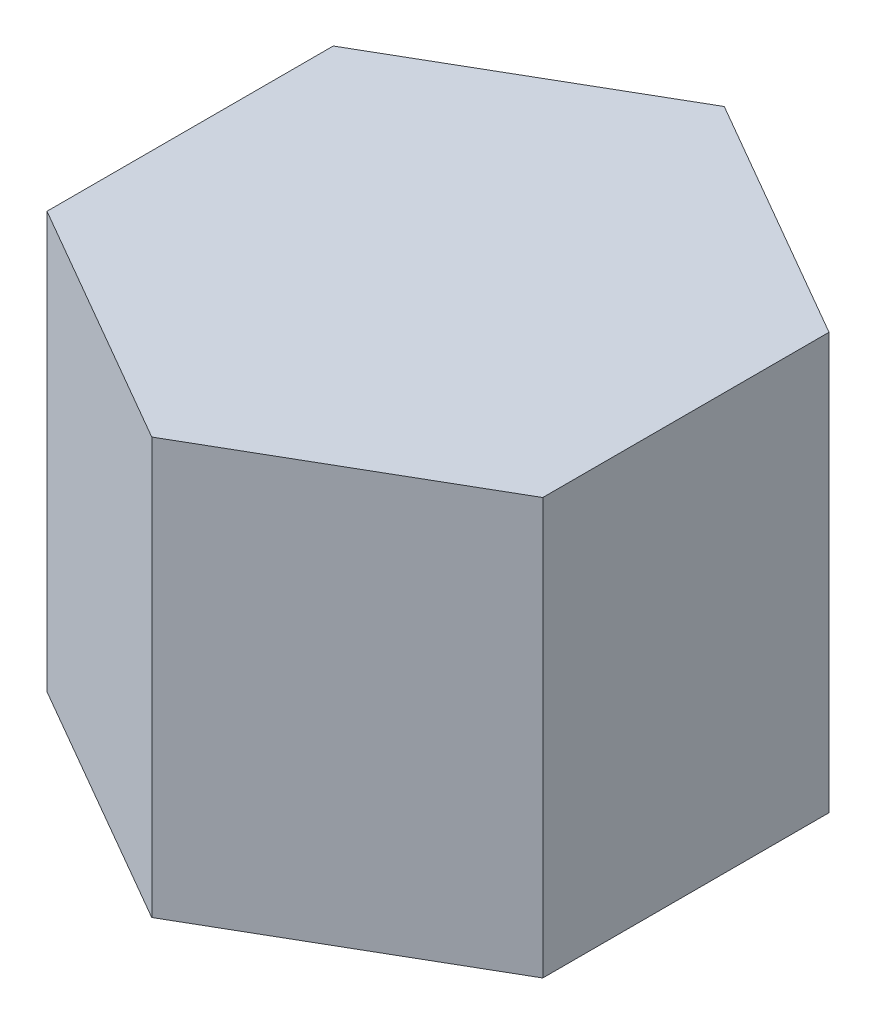
ISO-10303-21;
HEADER;
FILE_DESCRIPTION(('STEP AP214'),'2;1');
FILE_NAME('part.step','',(''),(''),'','','');
FILE_SCHEMA(('AUTOMOTIVE_DESIGN { 1 0 10303 214 1 1 1 1 }'));
ENDSEC;
DATA;
#1=APPLICATION_CONTEXT('core data for automotive mechanical design processes');
#2=APPLICATION_PROTOCOL_DEFINITION('international standard','automotive_design',2000,#1);
#3=PRODUCT_CONTEXT('',#1,'mechanical');
#4=PRODUCT('Part','Part','',(#3));
#5=PRODUCT_RELATED_PRODUCT_CATEGORY('part','',(#4));
#6=PRODUCT_DEFINITION_FORMATION('','',#4);
#7=PRODUCT_DEFINITION_CONTEXT('part definition',#1,'design');
#8=PRODUCT_DEFINITION('design','',#6,#7);
#9=PRODUCT_DEFINITION_SHAPE('','',#8);
#10=(LENGTH_UNIT() NAMED_UNIT(*) SI_UNIT(.MILLI.,.METRE.));
#11=(NAMED_UNIT(*) PLANE_ANGLE_UNIT() SI_UNIT($,.RADIAN.));
#12=(NAMED_UNIT(*) SI_UNIT($,.STERADIAN.) SOLID_ANGLE_UNIT());
#13=UNCERTAINTY_MEASURE_WITH_UNIT(LENGTH_MEASURE(1.E-05),#10,'distance_accuracy_value','');
#14=(GEOMETRIC_REPRESENTATION_CONTEXT(3) GLOBAL_UNCERTAINTY_ASSIGNED_CONTEXT((#13)) GLOBAL_UNIT_ASSIGNED_CONTEXT((#10,
#11,#12)) REPRESENTATION_CONTEXT('',''));
#15=CARTESIAN_POINT('',(0.,0.,0.));
#16=DIRECTION('',(0.,0.,1.));
#17=DIRECTION('',(1.,0.,0.));
#18=AXIS2_PLACEMENT_3D('',#15,#16,#17);
#19=CARTESIAN_POINT('',(207.339551417382,-147.556598747966,291.681971220494));
#20=DIRECTION('',(-0.500000000000028,0.,-0.866025403784422));
#21=DIRECTION('',(-0.866025403784423,0.,0.500000000000028));
#22=AXIS2_PLACEMENT_3D('',#19,#20,#21);
#23=PLANE('',#22);
#24=CARTESIAN_POINT('',(207.642660308706,-147.047793579175,291.506971220494));
#25=DIRECTION('',(-0.866025403784422,0.,0.500000000000028));
#26=VECTOR('',#25,1.);
#27=LINE('',#24,#26);
#28=CARTESIAN_POINT('',(207.642660308706,-147.047793579175,291.506971220494));
#29=VERTEX_POINT('',#28);
#30=CARTESIAN_POINT('',(207.339551417382,-147.047793579175,291.681971220494));
#31=VERTEX_POINT('',#30);
#32=EDGE_CURVE('E170',#29,#31,#27,.T.);
#33=ORIENTED_EDGE('',*,*,#32,.T.);
#34=CARTESIAN_POINT('',(207.339551417382,-147.556598747966,291.681971220494));
#35=DIRECTION('',(0.,1.,0.));
#36=VECTOR('',#35,1.);
#37=LINE('',#34,#36);
#38=CARTESIAN_POINT('',(207.339551417382,-147.556598747966,291.681971220494));
#39=VERTEX_POINT('',#38);
#40=EDGE_CURVE('E35',#39,#31,#37,.T.);
#41=ORIENTED_EDGE('',*,*,#40,.F.);
#42=CARTESIAN_POINT('',(207.642660308706,-147.556598747966,291.506971220494));
#43=DIRECTION('',(-0.866025403784422,0.,0.500000000000028));
#44=VECTOR('',#43,1.);
#45=LINE('',#42,#44);
#46=CARTESIAN_POINT('',(207.642660308706,-147.556598747966,291.506971220494));
#47=VERTEX_POINT('',#46);
#48=EDGE_CURVE('E159',#47,#39,#45,.T.);
#49=ORIENTED_EDGE('',*,*,#48,.F.);
#50=CARTESIAN_POINT('',(207.642660308706,-147.556598747966,291.506971220494));
#51=DIRECTION('',(0.,1.,0.));
#52=VECTOR('',#51,1.);
#53=LINE('',#50,#52);
#54=EDGE_CURVE('E10',#47,#29,#53,.T.);
#55=ORIENTED_EDGE('',*,*,#54,.T.);
#56=EDGE_LOOP('',(#33,#41,#49,#55));
#57=FACE_BOUND('',#56,.T.);
#58=ADVANCED_FACE('F16',(#57),#23,.F.);
#59=CARTESIAN_POINT('',(207.642660308706,-147.556598747966,291.594471220494));
#60=DIRECTION('',(-1.,0.,0.));
#61=DIRECTION('',(0.,-1.,0.));
#62=AXIS2_PLACEMENT_3D('',#59,#60,#61);
#63=PLANE('',#62);
#64=CARTESIAN_POINT('',(207.642660308706,-147.047793579175,291.156971220494));
#65=DIRECTION('',(0.,0.,1.));
#66=VECTOR('',#65,1.);
#67=LINE('',#64,#66);
#68=CARTESIAN_POINT('',(207.642660308706,-147.047793579175,291.156971220494));
#69=VERTEX_POINT('',#68);
#70=EDGE_CURVE('E167',#69,#29,#67,.T.);
#71=ORIENTED_EDGE('',*,*,#70,.T.);
#72=ORIENTED_EDGE('',*,*,#54,.F.);
#73=CARTESIAN_POINT('',(207.642660308706,-147.556598747966,291.156971220494));
#74=DIRECTION('',(0.,0.,1.));
#75=VECTOR('',#74,1.);
#76=LINE('',#73,#75);
#77=CARTESIAN_POINT('',(207.642660308706,-147.556598747966,291.156971220494));
#78=VERTEX_POINT('',#77);
#79=EDGE_CURVE('E156',#78,#47,#76,.T.);
#80=ORIENTED_EDGE('',*,*,#79,.F.);
#81=CARTESIAN_POINT('',(207.642660308706,-147.556598747966,291.156971220494));
#82=DIRECTION('',(0.,1.,0.));
#83=VECTOR('',#82,1.);
#84=LINE('',#81,#83);
#85=EDGE_CURVE('E27',#78,#69,#84,.T.);
#86=ORIENTED_EDGE('',*,*,#85,.T.);
#87=EDGE_LOOP('',(#71,#72,#80,#86));
#88=FACE_BOUND('',#87,.T.);
#89=ADVANCED_FACE('F189',(#88),#63,.F.);
#90=CARTESIAN_POINT('',(207.642660308706,-147.556598747966,291.156971220494));
#91=DIRECTION('',(-0.500000000000028,0.,0.866025403784422));
#92=DIRECTION('',(0.866025403784423,0.,0.500000000000028));
#93=AXIS2_PLACEMENT_3D('',#90,#91,#92);
#94=PLANE('',#93);
#95=CARTESIAN_POINT('',(207.339551417381,-147.047793579175,290.981971220494));
#96=DIRECTION('',(0.866025403784422,0.,0.500000000000028));
#97=VECTOR('',#96,1.);
#98=LINE('',#95,#97);
#99=CARTESIAN_POINT('',(207.339551417382,-147.047793579175,290.981971220494));
#100=VERTEX_POINT('',#99);
#101=EDGE_CURVE('E163',#100,#69,#98,.T.);
#102=ORIENTED_EDGE('',*,*,#101,.T.);
#103=ORIENTED_EDGE('',*,*,#85,.F.);
#104=CARTESIAN_POINT('',(207.339551417381,-147.556598747966,290.981971220494));
#105=DIRECTION('',(0.866025403784422,0.,0.500000000000028));
#106=VECTOR('',#105,1.);
#107=LINE('',#104,#106);
#108=CARTESIAN_POINT('',(207.339551417382,-147.556598747966,290.981971220494));
#109=VERTEX_POINT('',#108);
#110=EDGE_CURVE('E106',#109,#78,#107,.T.);
#111=ORIENTED_EDGE('',*,*,#110,.F.);
#112=CARTESIAN_POINT('',(207.339551417382,-147.556598747966,290.981971220494));
#113=DIRECTION('',(0.,1.,0.));
#114=VECTOR('',#113,1.);
#115=LINE('',#112,#114);
#116=EDGE_CURVE('E94',#109,#100,#115,.T.);
#117=ORIENTED_EDGE('',*,*,#116,.T.);
#118=EDGE_LOOP('',(#102,#103,#111,#117));
#119=FACE_BOUND('',#118,.T.);
#120=ADVANCED_FACE('F198',(#119),#94,.F.);
#121=CARTESIAN_POINT('',(207.339551417382,-147.556598747966,290.981971220494));
#122=DIRECTION('',(0.499999999999943,0.,0.866025403784471));
#123=DIRECTION('',(0.866025403784471,0.,-0.499999999999943));
#124=AXIS2_PLACEMENT_3D('',#121,#122,#123);
#125=PLANE('',#124);
#126=CARTESIAN_POINT('',(207.036442526057,-147.047793579175,291.156971220494));
#127=DIRECTION('',(0.866025403784471,0.,-0.499999999999943));
#128=VECTOR('',#127,1.);
#129=LINE('',#126,#128);
#130=CARTESIAN_POINT('',(207.036442526057,-147.047793579175,291.156971220494));
#131=VERTEX_POINT('',#130);
#132=EDGE_CURVE('E162',#131,#100,#129,.T.);
#133=ORIENTED_EDGE('',*,*,#132,.T.);
#134=ORIENTED_EDGE('',*,*,#116,.F.);
#135=CARTESIAN_POINT('',(207.036442526057,-147.556598747966,291.156971220494));
#136=DIRECTION('',(0.866025403784471,0.,-0.499999999999943));
#137=VECTOR('',#136,1.);
#138=LINE('',#135,#137);
#139=CARTESIAN_POINT('',(207.036442526057,-147.556598747966,291.156971220494));
#140=VERTEX_POINT('',#139);
#141=EDGE_CURVE('E98',#140,#109,#138,.T.);
#142=ORIENTED_EDGE('',*,*,#141,.F.);
#143=CARTESIAN_POINT('',(207.036442526057,-147.556598747966,291.156971220494));
#144=DIRECTION('',(0.,1.,0.));
#145=VECTOR('',#144,1.);
#146=LINE('',#143,#145);
#147=EDGE_CURVE('E79',#140,#131,#146,.T.);
#148=ORIENTED_EDGE('',*,*,#147,.T.);
#149=EDGE_LOOP('',(#133,#134,#142,#148));
#150=FACE_BOUND('',#149,.T.);
#151=ADVANCED_FACE('F100',(#150),#125,.F.);
#152=CARTESIAN_POINT('',(207.036442526057,-147.556598747966,291.594471220494));
#153=DIRECTION('',(1.,0.,0.));
#154=DIRECTION('',(0.,1.,0.));
#155=AXIS2_PLACEMENT_3D('',#152,#153,#154);
#156=PLANE('',#155);
#157=CARTESIAN_POINT('',(207.036442526057,-147.047793579175,291.506971220494));
#158=DIRECTION('',(0.,0.,-1.));
#159=VECTOR('',#158,1.);
#160=LINE('',#157,#159);
#161=CARTESIAN_POINT('',(207.036442526057,-147.047793579175,291.506971220494));
#162=VERTEX_POINT('',#161);
#163=EDGE_CURVE('E88',#162,#131,#160,.T.);
#164=ORIENTED_EDGE('',*,*,#163,.T.);
#165=ORIENTED_EDGE('',*,*,#147,.F.);
#166=CARTESIAN_POINT('',(207.036442526057,-147.556598747966,291.506971220494));
#167=DIRECTION('',(0.,0.,-1.));
#168=VECTOR('',#167,1.);
#169=LINE('',#166,#168);
#170=CARTESIAN_POINT('',(207.036442526057,-147.556598747966,291.506971220494));
#171=VERTEX_POINT('',#170);
#172=EDGE_CURVE('E84',#171,#140,#169,.T.);
#173=ORIENTED_EDGE('',*,*,#172,.F.);
#174=CARTESIAN_POINT('',(207.036442526057,-147.556598747966,291.506971220494));
#175=DIRECTION('',(0.,1.,0.));
#176=VECTOR('',#175,1.);
#177=LINE('',#174,#176);
#178=EDGE_CURVE('E58',#171,#162,#177,.T.);
#179=ORIENTED_EDGE('',*,*,#178,.T.);
#180=EDGE_LOOP('',(#164,#165,#173,#179));
#181=FACE_BOUND('',#180,.T.);
#182=ADVANCED_FACE('F82',(#181),#156,.F.);
#183=CARTESIAN_POINT('',(207.036442526057,-147.556598747966,291.506971220494));
#184=DIRECTION('',(0.500000000000062,0.,-0.866025403784403));
#185=DIRECTION('',(-0.866025403784403,0.,-0.500000000000062));
#186=AXIS2_PLACEMENT_3D('',#183,#184,#185);
#187=PLANE('',#186);
#188=CARTESIAN_POINT('',(207.339551417382,-147.047793579175,291.681971220494));
#189=DIRECTION('',(-0.866025403784403,0.,-0.500000000000062));
#190=VECTOR('',#189,1.);
#191=LINE('',#188,#190);
#192=EDGE_CURVE('E160',#31,#162,#191,.T.);
#193=ORIENTED_EDGE('',*,*,#192,.T.);
#194=ORIENTED_EDGE('',*,*,#178,.F.);
#195=CARTESIAN_POINT('',(207.339551417382,-147.556598747966,291.681971220494));
#196=DIRECTION('',(-0.866025403784403,0.,-0.500000000000062));
#197=VECTOR('',#196,1.);
#198=LINE('',#195,#197);
#199=EDGE_CURVE('E112',#39,#171,#198,.T.);
#200=ORIENTED_EDGE('',*,*,#199,.F.);
#201=ORIENTED_EDGE('',*,*,#40,.T.);
#202=EDGE_LOOP('',(#193,#194,#200,#201));
#203=FACE_BOUND('',#202,.T.);
#204=ADVANCED_FACE('F131',(#203),#187,.F.);
#205=CARTESIAN_POINT('',(206.491105863044,-147.556598747966,291.594471220494));
#206=DIRECTION('',(0.,1.,0.));
#207=DIRECTION('',(-1.,0.,0.));
#208=AXIS2_PLACEMENT_3D('',#205,#206,#207);
#209=PLANE('',#208);
#210=ORIENTED_EDGE('',*,*,#48,.T.);
#211=ORIENTED_EDGE('',*,*,#199,.T.);
#212=ORIENTED_EDGE('',*,*,#172,.T.);
#213=ORIENTED_EDGE('',*,*,#141,.T.);
#214=ORIENTED_EDGE('',*,*,#110,.T.);
#215=ORIENTED_EDGE('',*,*,#79,.T.);
#216=EDGE_LOOP('',(#210,#211,#212,#213,#214,#215));
#217=FACE_BOUND('',#216,.T.);
#218=ADVANCED_FACE('F111',(#217),#209,.F.);
#219=CARTESIAN_POINT('',(206.491105863044,-147.047793579175,291.594471220494));
#220=DIRECTION('',(0.,1.,0.));
#221=DIRECTION('',(-1.,0.,0.));
#222=AXIS2_PLACEMENT_3D('',#219,#220,#221);
#223=PLANE('',#222);
#224=ORIENTED_EDGE('',*,*,#32,.F.);
#225=ORIENTED_EDGE('',*,*,#70,.F.);
#226=ORIENTED_EDGE('',*,*,#101,.F.);
#227=ORIENTED_EDGE('',*,*,#132,.F.);
#228=ORIENTED_EDGE('',*,*,#163,.F.);
#229=ORIENTED_EDGE('',*,*,#192,.F.);
#230=EDGE_LOOP('',(#224,#225,#226,#227,#228,#229));
#231=FACE_BOUND('',#230,.T.);
#232=ADVANCED_FACE('F130',(#231),#223,.T.);
#233=CLOSED_SHELL('',(#58,#89,#120,#151,#182,#204,#218,#232));
#234=MANIFOLD_SOLID_BREP('B1',#233);
#235=ADVANCED_BREP_SHAPE_REPRESENTATION('',(#18,#234),#14);
#236=SHAPE_DEFINITION_REPRESENTATION(#9,#235);
ENDSEC;
END-ISO-10303-21;
